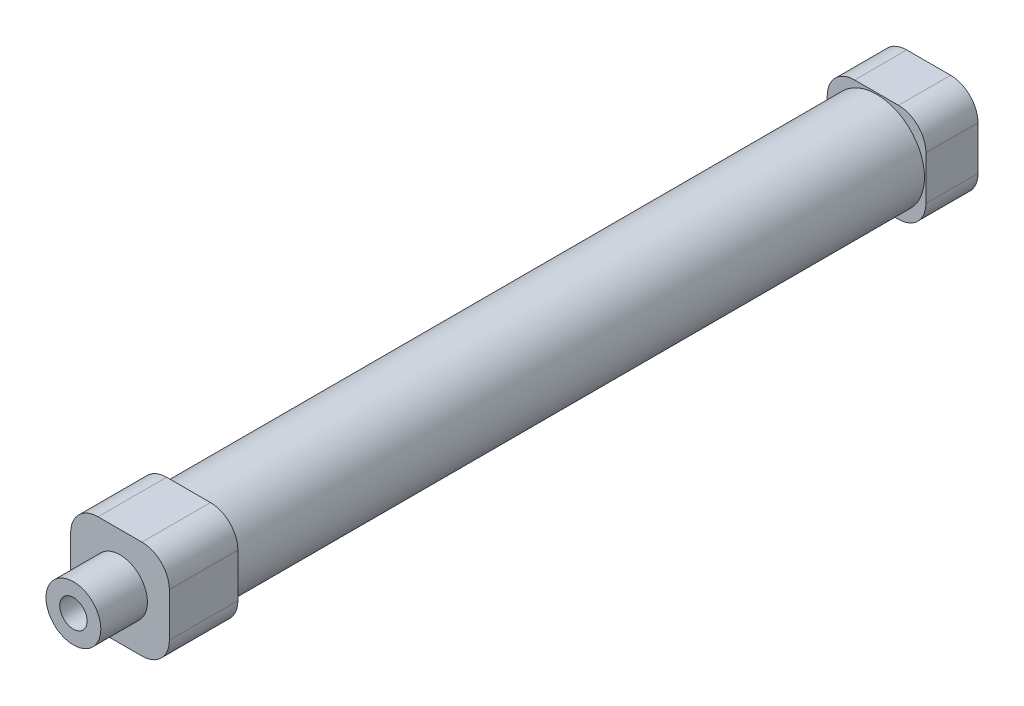
ISO-10303-21;
HEADER;
FILE_DESCRIPTION(('STEP AP214'),'2;1');
FILE_NAME('part.step','',(''),(''),'','','');
FILE_SCHEMA(('AUTOMOTIVE_DESIGN { 1 0 10303 214 1 1 1 1 }'));
ENDSEC;
DATA;
#1=APPLICATION_CONTEXT('core data for automotive mechanical design processes');
#2=APPLICATION_PROTOCOL_DEFINITION('international standard','automotive_design',2000,#1);
#3=PRODUCT_CONTEXT('',#1,'mechanical');
#4=PRODUCT('Part','Part','',(#3));
#5=PRODUCT_RELATED_PRODUCT_CATEGORY('part','',(#4));
#6=PRODUCT_DEFINITION_FORMATION('','',#4);
#7=PRODUCT_DEFINITION_CONTEXT('part definition',#1,'design');
#8=PRODUCT_DEFINITION('design','',#6,#7);
#9=PRODUCT_DEFINITION_SHAPE('','',#8);
#10=(LENGTH_UNIT() NAMED_UNIT(*) SI_UNIT(.MILLI.,.METRE.));
#11=(NAMED_UNIT(*) PLANE_ANGLE_UNIT() SI_UNIT($,.RADIAN.));
#12=(NAMED_UNIT(*) SI_UNIT($,.STERADIAN.) SOLID_ANGLE_UNIT());
#13=UNCERTAINTY_MEASURE_WITH_UNIT(LENGTH_MEASURE(1.E-05),#10,'distance_accuracy_value','');
#14=(GEOMETRIC_REPRESENTATION_CONTEXT(3) GLOBAL_UNCERTAINTY_ASSIGNED_CONTEXT((#13)) GLOBAL_UNIT_ASSIGNED_CONTEXT((#10,
#11,#12)) REPRESENTATION_CONTEXT('',''));
#15=CARTESIAN_POINT('',(0.,0.,0.));
#16=DIRECTION('',(0.,0.,1.));
#17=DIRECTION('',(1.,0.,0.));
#18=AXIS2_PLACEMENT_3D('',#15,#16,#17);
#19=CARTESIAN_POINT('',(0.,0.,147.5));
#20=DIRECTION('',(0.,0.,-1.));
#21=DIRECTION('',(-1.,0.,0.));
#22=AXIS2_PLACEMENT_3D('',#19,#20,#21);
#23=PLANE('',#22);
#24=DIRECTION('',(-1.,0.,0.));
#25=VECTOR('',#24,1.);
#26=CARTESIAN_POINT('',(-9.,9.,147.5));
#27=LINE('',#26,#25);
#28=CARTESIAN_POINT('',(4.,9.,147.5));
#29=VERTEX_POINT('',#28);
#30=CARTESIAN_POINT('',(-4.,9.,147.5));
#31=VERTEX_POINT('',#30);
#32=EDGE_CURVE('E196',#29,#31,#27,.T.);
#33=ORIENTED_EDGE('',*,*,#32,.T.);
#34=CARTESIAN_POINT('',(-4.,4.,147.5));
#35=DIRECTION('',(0.,0.,-1.));
#36=DIRECTION('',(-1.,0.,0.));
#37=AXIS2_PLACEMENT_3D('',#34,#35,#36);
#38=CIRCLE('',#37,5.);
#39=CARTESIAN_POINT('',(-9.,4.,147.5));
#40=VERTEX_POINT('',#39);
#41=EDGE_CURVE('E304',#31,#40,#38,.F.);
#42=ORIENTED_EDGE('',*,*,#41,.T.);
#43=DIRECTION('',(0.,-1.,0.));
#44=VECTOR('',#43,1.);
#45=CARTESIAN_POINT('',(-9.,-9.,147.5));
#46=LINE('',#45,#44);
#47=CARTESIAN_POINT('',(-9.,-4.,147.5));
#48=VERTEX_POINT('',#47);
#49=EDGE_CURVE('E200',#40,#48,#46,.T.);
#50=ORIENTED_EDGE('',*,*,#49,.T.);
#51=CARTESIAN_POINT('',(-4.,-4.,147.5));
#52=DIRECTION('',(0.,0.,-1.));
#53=DIRECTION('',(-1.,0.,0.));
#54=AXIS2_PLACEMENT_3D('',#51,#52,#53);
#55=CIRCLE('',#54,5.);
#56=CARTESIAN_POINT('',(-4.,-9.,147.5));
#57=VERTEX_POINT('',#56);
#58=EDGE_CURVE('E302',#48,#57,#55,.F.);
#59=ORIENTED_EDGE('',*,*,#58,.T.);
#60=DIRECTION('',(1.,0.,0.));
#61=VECTOR('',#60,1.);
#62=CARTESIAN_POINT('',(-9.,-9.,147.5));
#63=LINE('',#62,#61);
#64=CARTESIAN_POINT('',(4.,-9.,147.5));
#65=VERTEX_POINT('',#64);
#66=EDGE_CURVE('E203',#57,#65,#63,.T.);
#67=ORIENTED_EDGE('',*,*,#66,.T.);
#68=CARTESIAN_POINT('',(4.,-4.,147.5));
#69=DIRECTION('',(0.,0.,-1.));
#70=DIRECTION('',(-1.,0.,0.));
#71=AXIS2_PLACEMENT_3D('',#68,#69,#70);
#72=CIRCLE('',#71,5.);
#73=CARTESIAN_POINT('',(9.,-4.,147.5));
#74=VERTEX_POINT('',#73);
#75=EDGE_CURVE('E300',#65,#74,#72,.F.);
#76=ORIENTED_EDGE('',*,*,#75,.T.);
#77=DIRECTION('',(0.,1.,0.));
#78=VECTOR('',#77,1.);
#79=CARTESIAN_POINT('',(9.,-9.,147.5));
#80=LINE('',#79,#78);
#81=CARTESIAN_POINT('',(9.,4.,147.5));
#82=VERTEX_POINT('',#81);
#83=EDGE_CURVE('E193',#74,#82,#80,.T.);
#84=ORIENTED_EDGE('',*,*,#83,.T.);
#85=CARTESIAN_POINT('',(4.,4.,147.5));
#86=DIRECTION('',(0.,0.,-1.));
#87=DIRECTION('',(-1.,0.,0.));
#88=AXIS2_PLACEMENT_3D('',#85,#86,#87);
#89=CIRCLE('',#88,5.);
#90=EDGE_CURVE('E298',#82,#29,#89,.F.);
#91=ORIENTED_EDGE('',*,*,#90,.T.);
#92=EDGE_LOOP('',(#33,#42,#50,#59,#67,#76,#84,#91));
#93=FACE_BOUND('',#92,.T.);
#94=CARTESIAN_POINT('',(0.,0.,147.5));
#95=DIRECTION('',(0.,0.,-1.));
#96=DIRECTION('',(-1.,0.,0.));
#97=AXIS2_PLACEMENT_3D('',#94,#95,#96);
#98=CIRCLE('',#97,5.);
#99=CARTESIAN_POINT('',(-5.,0.,147.5));
#100=VERTEX_POINT('',#99);
#101=EDGE_CURVE('E236',#100,#100,#98,.F.);
#102=ORIENTED_EDGE('',*,*,#101,.F.);
#103=EDGE_LOOP('',(#102));
#104=FACE_BOUND('',#103,.T.);
#105=ADVANCED_FACE('F43',(#93,#104),#23,.F.);
#106=CARTESIAN_POINT('',(0.,0.,9.5));
#107=DIRECTION('',(0.,0.,1.));
#108=DIRECTION('',(1.,0.,0.));
#109=AXIS2_PLACEMENT_3D('',#106,#107,#108);
#110=PLANE('',#109);
#111=DIRECTION('',(-1.,0.,0.));
#112=VECTOR('',#111,1.);
#113=CARTESIAN_POINT('',(-9.,9.,9.5));
#114=LINE('',#113,#112);
#115=CARTESIAN_POINT('',(4.,9.,9.5));
#116=VERTEX_POINT('',#115);
#117=CARTESIAN_POINT('',(-4.,9.,9.5));
#118=VERTEX_POINT('',#117);
#119=EDGE_CURVE('E226',#116,#118,#114,.T.);
#120=ORIENTED_EDGE('',*,*,#119,.T.);
#121=CARTESIAN_POINT('',(-4.,4.,9.5));
#122=DIRECTION('',(0.,0.,1.));
#123=DIRECTION('',(1.,0.,0.));
#124=AXIS2_PLACEMENT_3D('',#121,#122,#123);
#125=CIRCLE('',#124,5.);
#126=CARTESIAN_POINT('',(-9.,4.,9.5));
#127=VERTEX_POINT('',#126);
#128=EDGE_CURVE('E273',#118,#127,#125,.T.);
#129=ORIENTED_EDGE('',*,*,#128,.T.);
#130=DIRECTION('',(0.,-1.,0.));
#131=VECTOR('',#130,1.);
#132=CARTESIAN_POINT('',(-9.,9.,9.5));
#133=LINE('',#132,#131);
#134=CARTESIAN_POINT('',(-9.,-4.,9.5));
#135=VERTEX_POINT('',#134);
#136=EDGE_CURVE('E230',#127,#135,#133,.T.);
#137=ORIENTED_EDGE('',*,*,#136,.T.);
#138=CARTESIAN_POINT('',(-4.,-4.,9.5));
#139=DIRECTION('',(0.,0.,1.));
#140=DIRECTION('',(1.,0.,0.));
#141=AXIS2_PLACEMENT_3D('',#138,#139,#140);
#142=CIRCLE('',#141,5.);
#143=CARTESIAN_POINT('',(-4.,-9.,9.5));
#144=VERTEX_POINT('',#143);
#145=EDGE_CURVE('E271',#135,#144,#142,.T.);
#146=ORIENTED_EDGE('',*,*,#145,.T.);
#147=DIRECTION('',(1.,0.,0.));
#148=VECTOR('',#147,1.);
#149=CARTESIAN_POINT('',(-9.,-9.,9.5));
#150=LINE('',#149,#148);
#151=CARTESIAN_POINT('',(4.,-9.,9.5));
#152=VERTEX_POINT('',#151);
#153=EDGE_CURVE('E233',#144,#152,#150,.T.);
#154=ORIENTED_EDGE('',*,*,#153,.T.);
#155=CARTESIAN_POINT('',(4.,-4.,9.5));
#156=DIRECTION('',(0.,0.,1.));
#157=DIRECTION('',(1.,0.,0.));
#158=AXIS2_PLACEMENT_3D('',#155,#156,#157);
#159=CIRCLE('',#158,5.);
#160=CARTESIAN_POINT('',(9.,-4.,9.5));
#161=VERTEX_POINT('',#160);
#162=EDGE_CURVE('E269',#152,#161,#159,.T.);
#163=ORIENTED_EDGE('',*,*,#162,.T.);
#164=DIRECTION('',(0.,1.,0.));
#165=VECTOR('',#164,1.);
#166=CARTESIAN_POINT('',(9.,9.,9.5));
#167=LINE('',#166,#165);
#168=CARTESIAN_POINT('',(9.,4.,9.5));
#169=VERTEX_POINT('',#168);
#170=EDGE_CURVE('E223',#161,#169,#167,.T.);
#171=ORIENTED_EDGE('',*,*,#170,.T.);
#172=CARTESIAN_POINT('',(4.,4.,9.5));
#173=DIRECTION('',(0.,0.,1.));
#174=DIRECTION('',(1.,0.,0.));
#175=AXIS2_PLACEMENT_3D('',#172,#173,#174);
#176=CIRCLE('',#175,5.);
#177=EDGE_CURVE('E267',#169,#116,#176,.T.);
#178=ORIENTED_EDGE('',*,*,#177,.T.);
#179=EDGE_LOOP('',(#120,#129,#137,#146,#154,#163,#171,#178));
#180=FACE_BOUND('',#179,.T.);
#181=CARTESIAN_POINT('',(0.,0.,9.5));
#182=DIRECTION('',(0.,0.,1.));
#183=DIRECTION('',(1.,0.,0.));
#184=AXIS2_PLACEMENT_3D('',#181,#182,#183);
#185=CIRCLE('',#184,8.75);
#186=CARTESIAN_POINT('',(8.74999999999999,0.,9.5));
#187=VERTEX_POINT('',#186);
#188=EDGE_CURVE('E206',#187,#187,#185,.T.);
#189=ORIENTED_EDGE('',*,*,#188,.F.);
#190=EDGE_LOOP('',(#189));
#191=FACE_BOUND('',#190,.T.);
#192=ADVANCED_FACE('F374',(#180,#191),#110,.T.);
#193=CARTESIAN_POINT('',(9.,9.,9.5));
#194=DIRECTION('',(-1.,0.,0.));
#195=DIRECTION('',(0.,0.,1.));
#196=AXIS2_PLACEMENT_3D('',#193,#194,#195);
#197=PLANE('',#196);
#198=ORIENTED_EDGE('',*,*,#170,.F.);
#199=DIRECTION('',(0.,0.,-1.));
#200=VECTOR('',#199,1.);
#201=CARTESIAN_POINT('',(9.,-4.,9.5));
#202=LINE('',#201,#200);
#203=CARTESIAN_POINT('',(9.,-4.,0.));
#204=VERTEX_POINT('',#203);
#205=EDGE_CURVE('E313',#161,#204,#202,.T.);
#206=ORIENTED_EDGE('',*,*,#205,.T.);
#207=DIRECTION('',(0.,1.,0.));
#208=VECTOR('',#207,1.);
#209=CARTESIAN_POINT('',(9.,9.,0.));
#210=LINE('',#209,#208);
#211=CARTESIAN_POINT('',(9.,4.,0.));
#212=VERTEX_POINT('',#211);
#213=EDGE_CURVE('E220',#204,#212,#210,.T.);
#214=ORIENTED_EDGE('',*,*,#213,.T.);
#215=DIRECTION('',(0.,0.,-1.));
#216=VECTOR('',#215,1.);
#217=CARTESIAN_POINT('',(9.,4.,9.5));
#218=LINE('',#217,#216);
#219=EDGE_CURVE('E311',#212,#169,#218,.F.);
#220=ORIENTED_EDGE('',*,*,#219,.T.);
#221=EDGE_LOOP('',(#198,#206,#214,#220));
#222=FACE_BOUND('',#221,.T.);
#223=ADVANCED_FACE('F379',(#222),#197,.F.);
#224=CARTESIAN_POINT('',(-9.,9.,9.5));
#225=DIRECTION('',(0.,-1.,0.));
#226=DIRECTION('',(0.,0.,-1.));
#227=AXIS2_PLACEMENT_3D('',#224,#225,#226);
#228=PLANE('',#227);
#229=DIRECTION('',(-1.,0.,0.));
#230=VECTOR('',#229,1.);
#231=CARTESIAN_POINT('',(-9.,9.,0.));
#232=LINE('',#231,#230);
#233=CARTESIAN_POINT('',(4.,9.,0.));
#234=VERTEX_POINT('',#233);
#235=CARTESIAN_POINT('',(-4.,9.,0.));
#236=VERTEX_POINT('',#235);
#237=EDGE_CURVE('E239',#234,#236,#232,.T.);
#238=ORIENTED_EDGE('',*,*,#237,.T.);
#239=DIRECTION('',(0.,0.,-1.));
#240=VECTOR('',#239,1.);
#241=CARTESIAN_POINT('',(-4.,9.,9.5));
#242=LINE('',#241,#240);
#243=EDGE_CURVE('E265',#236,#118,#242,.F.);
#244=ORIENTED_EDGE('',*,*,#243,.T.);
#245=ORIENTED_EDGE('',*,*,#119,.F.);
#246=DIRECTION('',(0.,0.,-1.));
#247=VECTOR('',#246,1.);
#248=CARTESIAN_POINT('',(4.,9.,9.5));
#249=LINE('',#248,#247);
#250=EDGE_CURVE('E262',#116,#234,#249,.T.);
#251=ORIENTED_EDGE('',*,*,#250,.T.);
#252=EDGE_LOOP('',(#238,#244,#245,#251));
#253=FACE_BOUND('',#252,.T.);
#254=ADVANCED_FACE('F412',(#253),#228,.F.);
#255=CARTESIAN_POINT('',(-9.,9.,9.5));
#256=DIRECTION('',(1.,0.,0.));
#257=DIRECTION('',(0.,1.,0.));
#258=AXIS2_PLACEMENT_3D('',#255,#256,#257);
#259=PLANE('',#258);
#260=ORIENTED_EDGE('',*,*,#136,.F.);
#261=DIRECTION('',(0.,0.,-1.));
#262=VECTOR('',#261,1.);
#263=CARTESIAN_POINT('',(-9.,4.,9.5));
#264=LINE('',#263,#262);
#265=CARTESIAN_POINT('',(-9.,4.,0.));
#266=VERTEX_POINT('',#265);
#267=EDGE_CURVE('E251',#127,#266,#264,.T.);
#268=ORIENTED_EDGE('',*,*,#267,.T.);
#269=DIRECTION('',(0.,-1.,0.));
#270=VECTOR('',#269,1.);
#271=CARTESIAN_POINT('',(-9.,9.,0.));
#272=LINE('',#271,#270);
#273=CARTESIAN_POINT('',(-9.,-4.,0.));
#274=VERTEX_POINT('',#273);
#275=EDGE_CURVE('E242',#266,#274,#272,.T.);
#276=ORIENTED_EDGE('',*,*,#275,.T.);
#277=DIRECTION('',(0.,0.,-1.));
#278=VECTOR('',#277,1.);
#279=CARTESIAN_POINT('',(-9.,-4.,9.5));
#280=LINE('',#279,#278);
#281=EDGE_CURVE('E249',#274,#135,#280,.F.);
#282=ORIENTED_EDGE('',*,*,#281,.T.);
#283=EDGE_LOOP('',(#260,#268,#276,#282));
#284=FACE_BOUND('',#283,.T.);
#285=ADVANCED_FACE('F408',(#284),#259,.F.);
#286=CARTESIAN_POINT('',(-9.,-9.,9.5));
#287=DIRECTION('',(0.,1.,0.));
#288=DIRECTION('',(0.,0.,1.));
#289=AXIS2_PLACEMENT_3D('',#286,#287,#288);
#290=PLANE('',#289);
#291=CARTESIAN_POINT('',(0.,-9.,4.75));
#292=DIRECTION('',(0.,-1.,0.));
#293=DIRECTION('',(0.,0.,-1.));
#294=AXIS2_PLACEMENT_3D('',#291,#292,#293);
#295=CIRCLE('',#294,2.5);
#296=CARTESIAN_POINT('',(0.,-9.,2.25));
#297=VERTEX_POINT('',#296);
#298=EDGE_CURVE('E181',#297,#297,#295,.T.);
#299=ORIENTED_EDGE('',*,*,#298,.F.);
#300=EDGE_LOOP('',(#299));
#301=FACE_BOUND('',#300,.T.);
#302=ORIENTED_EDGE('',*,*,#153,.F.);
#303=DIRECTION('',(0.,0.,-1.));
#304=VECTOR('',#303,1.);
#305=CARTESIAN_POINT('',(-4.,-9.,9.5));
#306=LINE('',#305,#304);
#307=CARTESIAN_POINT('',(-4.,-9.,0.));
#308=VERTEX_POINT('',#307);
#309=EDGE_CURVE('E277',#144,#308,#306,.T.);
#310=ORIENTED_EDGE('',*,*,#309,.T.);
#311=DIRECTION('',(1.,0.,0.));
#312=VECTOR('',#311,1.);
#313=CARTESIAN_POINT('',(-9.,-9.,0.));
#314=LINE('',#313,#312);
#315=CARTESIAN_POINT('',(4.,-9.,0.));
#316=VERTEX_POINT('',#315);
#317=EDGE_CURVE('E227',#308,#316,#314,.T.);
#318=ORIENTED_EDGE('',*,*,#317,.T.);
#319=DIRECTION('',(0.,0.,-1.));
#320=VECTOR('',#319,1.);
#321=CARTESIAN_POINT('',(4.,-9.,9.5));
#322=LINE('',#321,#320);
#323=EDGE_CURVE('E275',#316,#152,#322,.F.);
#324=ORIENTED_EDGE('',*,*,#323,.T.);
#325=EDGE_LOOP('',(#302,#310,#318,#324));
#326=FACE_BOUND('',#325,.T.);
#327=ADVANCED_FACE('F404',(#301,#326),#290,.F.);
#328=CARTESIAN_POINT('',(0.,0.,0.));
#329=DIRECTION('',(0.,0.,1.));
#330=DIRECTION('',(1.,0.,0.));
#331=AXIS2_PLACEMENT_3D('',#328,#329,#330);
#332=PLANE('',#331);
#333=ORIENTED_EDGE('',*,*,#275,.F.);
#334=CARTESIAN_POINT('',(-4.,4.,0.));
#335=DIRECTION('',(0.,0.,1.));
#336=DIRECTION('',(1.,0.,0.));
#337=AXIS2_PLACEMENT_3D('',#334,#335,#336);
#338=CIRCLE('',#337,5.);
#339=EDGE_CURVE('E260',#266,#236,#338,.F.);
#340=ORIENTED_EDGE('',*,*,#339,.T.);
#341=ORIENTED_EDGE('',*,*,#237,.F.);
#342=CARTESIAN_POINT('',(4.,4.,0.));
#343=DIRECTION('',(0.,0.,1.));
#344=DIRECTION('',(1.,0.,0.));
#345=AXIS2_PLACEMENT_3D('',#342,#343,#344);
#346=CIRCLE('',#345,5.);
#347=EDGE_CURVE('E254',#234,#212,#346,.F.);
#348=ORIENTED_EDGE('',*,*,#347,.T.);
#349=ORIENTED_EDGE('',*,*,#213,.F.);
#350=CARTESIAN_POINT('',(4.,-4.,0.));
#351=DIRECTION('',(0.,0.,1.));
#352=DIRECTION('',(1.,0.,0.));
#353=AXIS2_PLACEMENT_3D('',#350,#351,#352);
#354=CIRCLE('',#353,5.);
#355=EDGE_CURVE('E256',#204,#316,#354,.F.);
#356=ORIENTED_EDGE('',*,*,#355,.T.);
#357=ORIENTED_EDGE('',*,*,#317,.F.);
#358=CARTESIAN_POINT('',(-4.,-4.,0.));
#359=DIRECTION('',(0.,0.,1.));
#360=DIRECTION('',(1.,0.,0.));
#361=AXIS2_PLACEMENT_3D('',#358,#359,#360);
#362=CIRCLE('',#361,5.);
#363=EDGE_CURVE('E258',#308,#274,#362,.F.);
#364=ORIENTED_EDGE('',*,*,#363,.T.);
#365=EDGE_LOOP('',(#333,#340,#341,#348,#349,#356,#357,#364));
#366=FACE_BOUND('',#365,.T.);
#367=ADVANCED_FACE('F399',(#366),#332,.F.);
#368=CARTESIAN_POINT('',(0.,0.,135.));
#369=DIRECTION('',(0.,0.,-1.));
#370=DIRECTION('',(-1.,0.,0.));
#371=AXIS2_PLACEMENT_3D('',#368,#369,#370);
#372=CYLINDRICAL_SURFACE('',#371,8.75);
#373=CARTESIAN_POINT('',(0.,0.,135.));
#374=DIRECTION('',(0.,0.,1.));
#375=DIRECTION('',(1.,0.,0.));
#376=AXIS2_PLACEMENT_3D('',#373,#374,#375);
#377=CIRCLE('',#376,8.75);
#378=CARTESIAN_POINT('',(8.74999999999999,0.,135.));
#379=VERTEX_POINT('',#378);
#380=EDGE_CURVE('E217',#379,#379,#377,.T.);
#381=ORIENTED_EDGE('',*,*,#380,.F.);
#382=EDGE_LOOP('',(#381));
#383=FACE_BOUND('',#382,.T.);
#384=ORIENTED_EDGE('',*,*,#188,.T.);
#385=EDGE_LOOP('',(#384));
#386=FACE_BOUND('',#385,.T.);
#387=ADVANCED_FACE('F388',(#383,#386),#372,.T.);
#388=CARTESIAN_POINT('',(0.,0.,135.));
#389=DIRECTION('',(0.,0.,-1.));
#390=DIRECTION('',(-1.,0.,0.));
#391=AXIS2_PLACEMENT_3D('',#388,#389,#390);
#392=PLANE('',#391);
#393=DIRECTION('',(0.,-1.,0.));
#394=VECTOR('',#393,1.);
#395=CARTESIAN_POINT('',(-9.,-9.,135.));
#396=LINE('',#395,#394);
#397=CARTESIAN_POINT('',(-9.,4.,135.));
#398=VERTEX_POINT('',#397);
#399=CARTESIAN_POINT('',(-9.,-4.,135.));
#400=VERTEX_POINT('',#399);
#401=EDGE_CURVE('E212',#398,#400,#396,.T.);
#402=ORIENTED_EDGE('',*,*,#401,.F.);
#403=CARTESIAN_POINT('',(-4.,4.,135.));
#404=DIRECTION('',(0.,0.,-1.));
#405=DIRECTION('',(-1.,0.,0.));
#406=AXIS2_PLACEMENT_3D('',#403,#404,#405);
#407=CIRCLE('',#406,5.);
#408=CARTESIAN_POINT('',(-4.,9.,135.));
#409=VERTEX_POINT('',#408);
#410=EDGE_CURVE('E291',#398,#409,#407,.T.);
#411=ORIENTED_EDGE('',*,*,#410,.T.);
#412=DIRECTION('',(-1.,0.,0.));
#413=VECTOR('',#412,1.);
#414=CARTESIAN_POINT('',(-9.,9.,135.));
#415=LINE('',#414,#413);
#416=CARTESIAN_POINT('',(4.,9.,135.));
#417=VERTEX_POINT('',#416);
#418=EDGE_CURVE('E209',#417,#409,#415,.T.);
#419=ORIENTED_EDGE('',*,*,#418,.F.);
#420=CARTESIAN_POINT('',(4.,4.,135.));
#421=DIRECTION('',(0.,0.,-1.));
#422=DIRECTION('',(-1.,0.,0.));
#423=AXIS2_PLACEMENT_3D('',#420,#421,#422);
#424=CIRCLE('',#423,5.);
#425=CARTESIAN_POINT('',(9.,4.,135.));
#426=VERTEX_POINT('',#425);
#427=EDGE_CURVE('E285',#417,#426,#424,.T.);
#428=ORIENTED_EDGE('',*,*,#427,.T.);
#429=DIRECTION('',(0.,1.,0.));
#430=VECTOR('',#429,1.);
#431=CARTESIAN_POINT('',(9.,-9.,135.));
#432=LINE('',#431,#430);
#433=CARTESIAN_POINT('',(9.,-4.,135.));
#434=VERTEX_POINT('',#433);
#435=EDGE_CURVE('E192',#434,#426,#432,.T.);
#436=ORIENTED_EDGE('',*,*,#435,.F.);
#437=CARTESIAN_POINT('',(4.,-4.,135.));
#438=DIRECTION('',(0.,0.,-1.));
#439=DIRECTION('',(-1.,0.,0.));
#440=AXIS2_PLACEMENT_3D('',#437,#438,#439);
#441=CIRCLE('',#440,5.);
#442=CARTESIAN_POINT('',(4.,-9.,135.));
#443=VERTEX_POINT('',#442);
#444=EDGE_CURVE('E287',#434,#443,#441,.T.);
#445=ORIENTED_EDGE('',*,*,#444,.T.);
#446=DIRECTION('',(1.,0.,0.));
#447=VECTOR('',#446,1.);
#448=CARTESIAN_POINT('',(-9.,-9.,135.));
#449=LINE('',#448,#447);
#450=CARTESIAN_POINT('',(-4.,-9.,135.));
#451=VERTEX_POINT('',#450);
#452=EDGE_CURVE('E197',#451,#443,#449,.T.);
#453=ORIENTED_EDGE('',*,*,#452,.F.);
#454=CARTESIAN_POINT('',(-4.,-4.,135.));
#455=DIRECTION('',(0.,0.,-1.));
#456=DIRECTION('',(-1.,0.,0.));
#457=AXIS2_PLACEMENT_3D('',#454,#455,#456);
#458=CIRCLE('',#457,5.);
#459=EDGE_CURVE('E289',#451,#400,#458,.T.);
#460=ORIENTED_EDGE('',*,*,#459,.T.);
#461=EDGE_LOOP('',(#402,#411,#419,#428,#436,#445,#453,#460));
#462=FACE_BOUND('',#461,.T.);
#463=ORIENTED_EDGE('',*,*,#380,.T.);
#464=EDGE_LOOP('',(#463));
#465=FACE_BOUND('',#464,.T.);
#466=ADVANCED_FACE('F332',(#462,#465),#392,.T.);
#467=CARTESIAN_POINT('',(9.,-9.,147.5));
#468=DIRECTION('',(-1.,0.,0.));
#469=DIRECTION('',(0.,0.,1.));
#470=AXIS2_PLACEMENT_3D('',#467,#468,#469);
#471=PLANE('',#470);
#472=ORIENTED_EDGE('',*,*,#83,.F.);
#473=DIRECTION('',(0.,0.,-1.));
#474=VECTOR('',#473,1.);
#475=CARTESIAN_POINT('',(9.,-4.,147.5));
#476=LINE('',#475,#474);
#477=EDGE_CURVE('E318',#74,#434,#476,.T.);
#478=ORIENTED_EDGE('',*,*,#477,.T.);
#479=ORIENTED_EDGE('',*,*,#435,.T.);
#480=DIRECTION('',(0.,0.,-1.));
#481=VECTOR('',#480,1.);
#482=CARTESIAN_POINT('',(9.,4.,147.5));
#483=LINE('',#482,#481);
#484=EDGE_CURVE('E316',#426,#82,#483,.F.);
#485=ORIENTED_EDGE('',*,*,#484,.T.);
#486=EDGE_LOOP('',(#472,#478,#479,#485));
#487=FACE_BOUND('',#486,.T.);
#488=ADVANCED_FACE('F326',(#487),#471,.F.);
#489=CARTESIAN_POINT('',(-9.,9.,147.5));
#490=DIRECTION('',(0.,-1.,0.));
#491=DIRECTION('',(0.,0.,-1.));
#492=AXIS2_PLACEMENT_3D('',#489,#490,#491);
#493=PLANE('',#492);
#494=ORIENTED_EDGE('',*,*,#418,.T.);
#495=DIRECTION('',(0.,0.,-1.));
#496=VECTOR('',#495,1.);
#497=CARTESIAN_POINT('',(-4.,9.,147.5));
#498=LINE('',#497,#496);
#499=EDGE_CURVE('E296',#409,#31,#498,.F.);
#500=ORIENTED_EDGE('',*,*,#499,.T.);
#501=ORIENTED_EDGE('',*,*,#32,.F.);
#502=DIRECTION('',(0.,0.,-1.));
#503=VECTOR('',#502,1.);
#504=CARTESIAN_POINT('',(4.,9.,147.5));
#505=LINE('',#504,#503);
#506=EDGE_CURVE('E293',#29,#417,#505,.T.);
#507=ORIENTED_EDGE('',*,*,#506,.T.);
#508=EDGE_LOOP('',(#494,#500,#501,#507));
#509=FACE_BOUND('',#508,.T.);
#510=ADVANCED_FACE('F341',(#509),#493,.F.);
#511=CARTESIAN_POINT('',(-9.,-9.,147.5));
#512=DIRECTION('',(1.,0.,0.));
#513=DIRECTION('',(0.,0.,-1.));
#514=AXIS2_PLACEMENT_3D('',#511,#512,#513);
#515=PLANE('',#514);
#516=ORIENTED_EDGE('',*,*,#49,.F.);
#517=DIRECTION('',(0.,0.,-1.));
#518=VECTOR('',#517,1.);
#519=CARTESIAN_POINT('',(-9.,4.,147.5));
#520=LINE('',#519,#518);
#521=EDGE_CURVE('E282',#40,#398,#520,.T.);
#522=ORIENTED_EDGE('',*,*,#521,.T.);
#523=ORIENTED_EDGE('',*,*,#401,.T.);
#524=DIRECTION('',(0.,0.,-1.));
#525=VECTOR('',#524,1.);
#526=CARTESIAN_POINT('',(-9.,-4.,147.5));
#527=LINE('',#526,#525);
#528=EDGE_CURVE('E280',#400,#48,#527,.F.);
#529=ORIENTED_EDGE('',*,*,#528,.T.);
#530=EDGE_LOOP('',(#516,#522,#523,#529));
#531=FACE_BOUND('',#530,.T.);
#532=ADVANCED_FACE('F351',(#531),#515,.F.);
#533=CARTESIAN_POINT('',(-9.,-9.,147.5));
#534=DIRECTION('',(0.,1.,0.));
#535=DIRECTION('',(0.,0.,1.));
#536=AXIS2_PLACEMENT_3D('',#533,#534,#535);
#537=PLANE('',#536);
#538=CARTESIAN_POINT('',(0.,-9.,139.75));
#539=DIRECTION('',(0.,-1.,0.));
#540=DIRECTION('',(0.,0.,-1.));
#541=AXIS2_PLACEMENT_3D('',#538,#539,#540);
#542=CIRCLE('',#541,2.5);
#543=CARTESIAN_POINT('',(0.,-9.,137.25));
#544=VERTEX_POINT('',#543);
#545=EDGE_CURVE('E186',#544,#544,#542,.T.);
#546=ORIENTED_EDGE('',*,*,#545,.F.);
#547=EDGE_LOOP('',(#546));
#548=FACE_BOUND('',#547,.T.);
#549=ORIENTED_EDGE('',*,*,#66,.F.);
#550=DIRECTION('',(0.,0.,-1.));
#551=VECTOR('',#550,1.);
#552=CARTESIAN_POINT('',(-4.,-9.,147.5));
#553=LINE('',#552,#551);
#554=EDGE_CURVE('E308',#57,#451,#553,.T.);
#555=ORIENTED_EDGE('',*,*,#554,.T.);
#556=ORIENTED_EDGE('',*,*,#452,.T.);
#557=DIRECTION('',(0.,0.,-1.));
#558=VECTOR('',#557,1.);
#559=CARTESIAN_POINT('',(4.,-9.,147.5));
#560=LINE('',#559,#558);
#561=EDGE_CURVE('E306',#443,#65,#560,.F.);
#562=ORIENTED_EDGE('',*,*,#561,.T.);
#563=EDGE_LOOP('',(#549,#555,#556,#562));
#564=FACE_BOUND('',#563,.T.);
#565=ADVANCED_FACE('F359',(#548,#564),#537,.F.);
#566=CARTESIAN_POINT('',(0.,0.,156.));
#567=DIRECTION('',(0.,0.,-1.));
#568=DIRECTION('',(-1.,0.,0.));
#569=AXIS2_PLACEMENT_3D('',#566,#567,#568);
#570=CYLINDRICAL_SURFACE('',#569,5.);
#571=CARTESIAN_POINT('',(0.,0.,156.));
#572=DIRECTION('',(0.,0.,1.));
#573=DIRECTION('',(1.,0.,0.));
#574=AXIS2_PLACEMENT_3D('',#571,#572,#573);
#575=CIRCLE('',#574,5.);
#576=CARTESIAN_POINT('',(5.,0.,156.));
#577=VERTEX_POINT('',#576);
#578=EDGE_CURVE('E183',#577,#577,#575,.T.);
#579=ORIENTED_EDGE('',*,*,#578,.F.);
#580=EDGE_LOOP('',(#579));
#581=FACE_BOUND('',#580,.T.);
#582=ORIENTED_EDGE('',*,*,#101,.T.);
#583=EDGE_LOOP('',(#582));
#584=FACE_BOUND('',#583,.T.);
#585=ADVANCED_FACE('F384',(#581,#584),#570,.T.);
#586=CARTESIAN_POINT('',(0.,0.,156.));
#587=DIRECTION('',(0.,0.,1.));
#588=DIRECTION('',(1.,0.,0.));
#589=AXIS2_PLACEMENT_3D('',#586,#587,#588);
#590=PLANE('',#589);
#591=CARTESIAN_POINT('',(0.,0.,156.));
#592=DIRECTION('',(0.,0.,1.));
#593=DIRECTION('',(1.,0.,0.));
#594=AXIS2_PLACEMENT_3D('',#591,#592,#593);
#595=CIRCLE('',#594,2.5);
#596=CARTESIAN_POINT('',(2.5,0.,156.));
#597=VERTEX_POINT('',#596);
#598=EDGE_CURVE('E179',#597,#597,#595,.T.);
#599=ORIENTED_EDGE('',*,*,#598,.F.);
#600=EDGE_LOOP('',(#599));
#601=FACE_BOUND('',#600,.T.);
#602=ORIENTED_EDGE('',*,*,#578,.T.);
#603=EDGE_LOOP('',(#602));
#604=FACE_BOUND('',#603,.T.);
#605=ADVANCED_FACE('F169',(#601,#604),#590,.T.);
#606=CARTESIAN_POINT('',(0.,0.,-7.07106781186545));
#607=DIRECTION('',(0.,0.,1.));
#608=DIRECTION('',(1.,0.,0.));
#609=AXIS2_PLACEMENT_3D('',#606,#607,#608);
#610=CYLINDRICAL_SURFACE('',#609,2.5);
#611=CARTESIAN_POINT('',(0.,0.,139.75));
#612=DIRECTION('',(0.,0.707106781186547,0.707106781186547));
#613=DIRECTION('',(0.,-0.707106781186547,0.707106781186547));
#614=AXIS2_PLACEMENT_3D('',#611,#612,#613);
#615=ELLIPSE('',#614,3.53553390593274,2.5);
#616=CARTESIAN_POINT('',(2.5,0.,139.75));
#617=VERTEX_POINT('',#616);
#618=CARTESIAN_POINT('',(-2.5,0.,139.75));
#619=VERTEX_POINT('',#618);
#620=EDGE_CURVE('E51',#617,#619,#615,.F.);
#621=ORIENTED_EDGE('',*,*,#620,.T.);
#622=CARTESIAN_POINT('',(0.,0.,139.75));
#623=DIRECTION('',(0.,-0.707106781186547,0.707106781186547));
#624=DIRECTION('',(0.,0.707106781186547,0.707106781186547));
#625=AXIS2_PLACEMENT_3D('',#622,#623,#624);
#626=ELLIPSE('',#625,3.53553390593274,2.5);
#627=EDGE_CURVE('E12',#619,#617,#626,.T.);
#628=ORIENTED_EDGE('',*,*,#627,.T.);
#629=EDGE_LOOP('',(#621,#628));
#630=FACE_BOUND('',#629,.T.);
#631=CARTESIAN_POINT('',(0.,0.,4.75));
#632=DIRECTION('',(0.,0.707106781186547,0.707106781186547));
#633=DIRECTION('',(0.,-0.707106781186547,0.707106781186547));
#634=AXIS2_PLACEMENT_3D('',#631,#632,#633);
#635=ELLIPSE('',#634,3.53553390593274,2.5);
#636=CARTESIAN_POINT('',(2.49999999999999,0.,4.75));
#637=VERTEX_POINT('',#636);
#638=CARTESIAN_POINT('',(-2.50000000000001,0.,4.75));
#639=VERTEX_POINT('',#638);
#640=EDGE_CURVE('E172',#637,#639,#635,.F.);
#641=ORIENTED_EDGE('',*,*,#640,.T.);
#642=CARTESIAN_POINT('',(0.,0.,4.75));
#643=DIRECTION('',(0.,-0.707106781186547,0.707106781186547));
#644=DIRECTION('',(0.,0.707106781186547,0.707106781186547));
#645=AXIS2_PLACEMENT_3D('',#642,#643,#644);
#646=ELLIPSE('',#645,3.53553390593274,2.5);
#647=EDGE_CURVE('E62',#639,#637,#646,.T.);
#648=ORIENTED_EDGE('',*,*,#647,.T.);
#649=EDGE_LOOP('',(#641,#648));
#650=FACE_BOUND('',#649,.T.);
#651=CARTESIAN_POINT('',(0.,0.,1.));
#652=DIRECTION('',(0.,0.,1.));
#653=DIRECTION('',(1.,0.,0.));
#654=AXIS2_PLACEMENT_3D('',#651,#652,#653);
#655=CIRCLE('',#654,2.5);
#656=CARTESIAN_POINT('',(2.5,0.,1.));
#657=VERTEX_POINT('',#656);
#658=EDGE_CURVE('E176',#657,#657,#655,.F.);
#659=ORIENTED_EDGE('',*,*,#658,.T.);
#660=EDGE_LOOP('',(#659));
#661=FACE_BOUND('',#660,.T.);
#662=ORIENTED_EDGE('',*,*,#598,.T.);
#663=EDGE_LOOP('',(#662));
#664=FACE_BOUND('',#663,.T.);
#665=ADVANCED_FACE('F165',(#630,#650,#661,#664),#610,.F.);
#666=CARTESIAN_POINT('',(0.,0.,1.));
#667=DIRECTION('',(0.,0.,1.));
#668=DIRECTION('',(1.,0.,0.));
#669=AXIS2_PLACEMENT_3D('',#666,#667,#668);
#670=PLANE('',#669);
#671=ORIENTED_EDGE('',*,*,#658,.F.);
#672=EDGE_LOOP('',(#671));
#673=FACE_BOUND('',#672,.T.);
#674=ADVANCED_FACE('F168',(#673),#670,.T.);
#675=CARTESIAN_POINT('',(-4.,4.,9.5));
#676=DIRECTION('',(0.,0.,-1.));
#677=DIRECTION('',(-1.,0.,0.));
#678=AXIS2_PLACEMENT_3D('',#675,#676,#677);
#679=CYLINDRICAL_SURFACE('',#678,5.);
#680=ORIENTED_EDGE('',*,*,#128,.F.);
#681=ORIENTED_EDGE('',*,*,#243,.F.);
#682=ORIENTED_EDGE('',*,*,#339,.F.);
#683=ORIENTED_EDGE('',*,*,#267,.F.);
#684=EDGE_LOOP('',(#680,#681,#682,#683));
#685=FACE_BOUND('',#684,.T.);
#686=ADVANCED_FACE('F420',(#685),#679,.T.);
#687=CARTESIAN_POINT('',(-4.,-4.,9.5));
#688=DIRECTION('',(0.,0.,-1.));
#689=DIRECTION('',(-1.,0.,0.));
#690=AXIS2_PLACEMENT_3D('',#687,#688,#689);
#691=CYLINDRICAL_SURFACE('',#690,5.);
#692=ORIENTED_EDGE('',*,*,#145,.F.);
#693=ORIENTED_EDGE('',*,*,#281,.F.);
#694=ORIENTED_EDGE('',*,*,#363,.F.);
#695=ORIENTED_EDGE('',*,*,#309,.F.);
#696=EDGE_LOOP('',(#692,#693,#694,#695));
#697=FACE_BOUND('',#696,.T.);
#698=ADVANCED_FACE('F423',(#697),#691,.T.);
#699=CARTESIAN_POINT('',(-4.,4.,147.5));
#700=DIRECTION('',(0.,0.,-1.));
#701=DIRECTION('',(-1.,0.,0.));
#702=AXIS2_PLACEMENT_3D('',#699,#700,#701);
#703=CYLINDRICAL_SURFACE('',#702,5.);
#704=ORIENTED_EDGE('',*,*,#41,.F.);
#705=ORIENTED_EDGE('',*,*,#499,.F.);
#706=ORIENTED_EDGE('',*,*,#410,.F.);
#707=ORIENTED_EDGE('',*,*,#521,.F.);
#708=EDGE_LOOP('',(#704,#705,#706,#707));
#709=FACE_BOUND('',#708,.T.);
#710=ADVANCED_FACE('F349',(#709),#703,.T.);
#711=CARTESIAN_POINT('',(-4.,-4.,147.5));
#712=DIRECTION('',(0.,0.,-1.));
#713=DIRECTION('',(-1.,0.,0.));
#714=AXIS2_PLACEMENT_3D('',#711,#712,#713);
#715=CYLINDRICAL_SURFACE('',#714,5.);
#716=ORIENTED_EDGE('',*,*,#58,.F.);
#717=ORIENTED_EDGE('',*,*,#528,.F.);
#718=ORIENTED_EDGE('',*,*,#459,.F.);
#719=ORIENTED_EDGE('',*,*,#554,.F.);
#720=EDGE_LOOP('',(#716,#717,#718,#719));
#721=FACE_BOUND('',#720,.T.);
#722=ADVANCED_FACE('F356',(#721),#715,.T.);
#723=CARTESIAN_POINT('',(4.,-4.,9.5));
#724=DIRECTION('',(0.,0.,-1.));
#725=DIRECTION('',(-1.,0.,0.));
#726=AXIS2_PLACEMENT_3D('',#723,#724,#725);
#727=CYLINDRICAL_SURFACE('',#726,5.);
#728=ORIENTED_EDGE('',*,*,#162,.F.);
#729=ORIENTED_EDGE('',*,*,#323,.F.);
#730=ORIENTED_EDGE('',*,*,#355,.F.);
#731=ORIENTED_EDGE('',*,*,#205,.F.);
#732=EDGE_LOOP('',(#728,#729,#730,#731));
#733=FACE_BOUND('',#732,.T.);
#734=ADVANCED_FACE('F364',(#733),#727,.T.);
#735=CARTESIAN_POINT('',(4.,-4.,147.5));
#736=DIRECTION('',(0.,0.,-1.));
#737=DIRECTION('',(-1.,0.,0.));
#738=AXIS2_PLACEMENT_3D('',#735,#736,#737);
#739=CYLINDRICAL_SURFACE('',#738,5.);
#740=ORIENTED_EDGE('',*,*,#75,.F.);
#741=ORIENTED_EDGE('',*,*,#561,.F.);
#742=ORIENTED_EDGE('',*,*,#444,.F.);
#743=ORIENTED_EDGE('',*,*,#477,.F.);
#744=EDGE_LOOP('',(#740,#741,#742,#743));
#745=FACE_BOUND('',#744,.T.);
#746=ADVANCED_FACE('F361',(#745),#739,.T.);
#747=CARTESIAN_POINT('',(4.,4.,9.5));
#748=DIRECTION('',(0.,0.,-1.));
#749=DIRECTION('',(-1.,0.,0.));
#750=AXIS2_PLACEMENT_3D('',#747,#748,#749);
#751=CYLINDRICAL_SURFACE('',#750,5.);
#752=ORIENTED_EDGE('',*,*,#177,.F.);
#753=ORIENTED_EDGE('',*,*,#219,.F.);
#754=ORIENTED_EDGE('',*,*,#347,.F.);
#755=ORIENTED_EDGE('',*,*,#250,.F.);
#756=EDGE_LOOP('',(#752,#753,#754,#755));
#757=FACE_BOUND('',#756,.T.);
#758=ADVANCED_FACE('F363',(#757),#751,.T.);
#759=CARTESIAN_POINT('',(4.,4.,147.5));
#760=DIRECTION('',(0.,0.,-1.));
#761=DIRECTION('',(-1.,0.,0.));
#762=AXIS2_PLACEMENT_3D('',#759,#760,#761);
#763=CYLINDRICAL_SURFACE('',#762,5.);
#764=ORIENTED_EDGE('',*,*,#90,.F.);
#765=ORIENTED_EDGE('',*,*,#484,.F.);
#766=ORIENTED_EDGE('',*,*,#427,.F.);
#767=ORIENTED_EDGE('',*,*,#506,.F.);
#768=EDGE_LOOP('',(#764,#765,#766,#767));
#769=FACE_BOUND('',#768,.T.);
#770=ADVANCED_FACE('F45',(#769),#763,.T.);
#771=CARTESIAN_POINT('',(0.,7.07106781186548,4.75));
#772=DIRECTION('',(0.,-1.,0.));
#773=DIRECTION('',(0.,0.,-1.));
#774=AXIS2_PLACEMENT_3D('',#771,#772,#773);
#775=CYLINDRICAL_SURFACE('',#774,2.5);
#776=ORIENTED_EDGE('',*,*,#298,.T.);
#777=EDGE_LOOP('',(#776));
#778=FACE_BOUND('',#777,.T.);
#779=ORIENTED_EDGE('',*,*,#640,.F.);
#780=ORIENTED_EDGE('',*,*,#647,.F.);
#781=EDGE_LOOP('',(#779,#780));
#782=FACE_BOUND('',#781,.T.);
#783=ADVANCED_FACE('F458',(#778,#782),#775,.F.);
#784=CARTESIAN_POINT('',(0.,7.07106781186548,139.75));
#785=DIRECTION('',(0.,-1.,0.));
#786=DIRECTION('',(0.,0.,-1.));
#787=AXIS2_PLACEMENT_3D('',#784,#785,#786);
#788=CYLINDRICAL_SURFACE('',#787,2.5);
#789=ORIENTED_EDGE('',*,*,#545,.T.);
#790=EDGE_LOOP('',(#789));
#791=FACE_BOUND('',#790,.T.);
#792=ORIENTED_EDGE('',*,*,#620,.F.);
#793=ORIENTED_EDGE('',*,*,#627,.F.);
#794=EDGE_LOOP('',(#792,#793));
#795=FACE_BOUND('',#794,.T.);
#796=ADVANCED_FACE('F163',(#791,#795),#788,.F.);
#797=CLOSED_SHELL('',(#105,#192,#223,#254,#285,#327,#367,#387,#466,#488,#510,#532,#565,#585,
#605,#665,#674,#686,#698,#710,#722,#734,#746,#758,#770,#783,#796));
#798=MANIFOLD_SOLID_BREP('B2',#797);
#799=ADVANCED_BREP_SHAPE_REPRESENTATION('',(#18,#798),#14);
#800=SHAPE_DEFINITION_REPRESENTATION(#9,#799);
ENDSEC;
END-ISO-10303-21;
